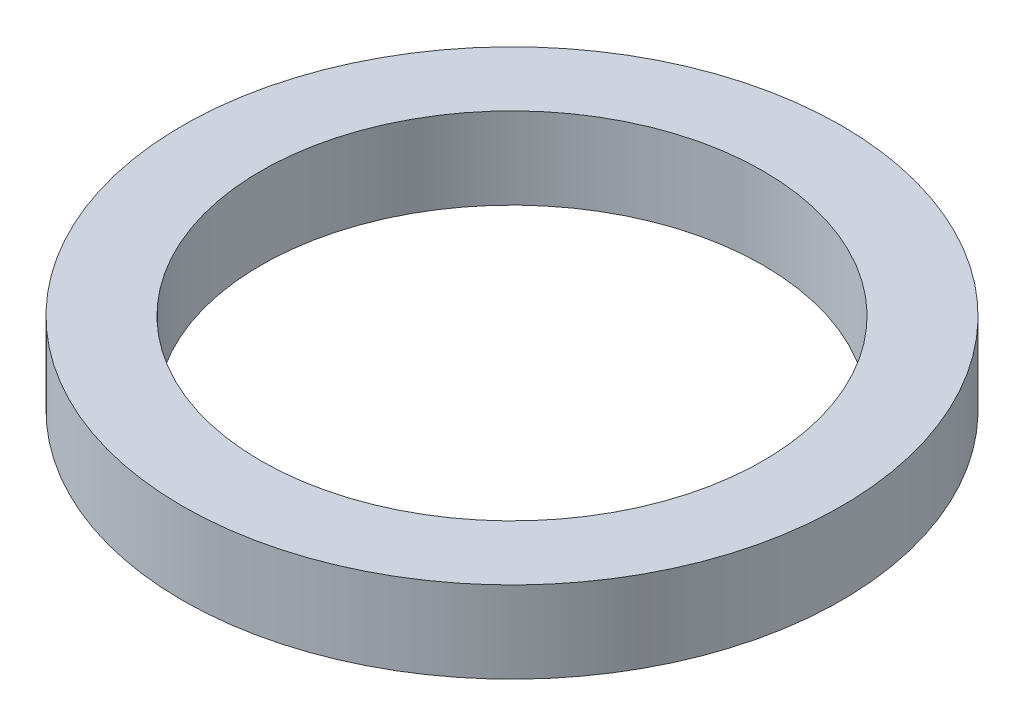
ISO-10303-21;
HEADER;
FILE_DESCRIPTION(('STEP AP214'),'2;1');
FILE_NAME('part.step','',(''),(''),'','','');
FILE_SCHEMA(('AUTOMOTIVE_DESIGN { 1 0 10303 214 1 1 1 1 }'));
ENDSEC;
DATA;
#1=APPLICATION_CONTEXT('core data for automotive mechanical design processes');
#2=APPLICATION_PROTOCOL_DEFINITION('international standard','automotive_design',2000,#1);
#3=PRODUCT_CONTEXT('',#1,'mechanical');
#4=PRODUCT('Part','Part','',(#3));
#5=PRODUCT_RELATED_PRODUCT_CATEGORY('part','',(#4));
#6=PRODUCT_DEFINITION_FORMATION('','',#4);
#7=PRODUCT_DEFINITION_CONTEXT('part definition',#1,'design');
#8=PRODUCT_DEFINITION('design','',#6,#7);
#9=PRODUCT_DEFINITION_SHAPE('','',#8);
#10=(LENGTH_UNIT() NAMED_UNIT(*) SI_UNIT(.MILLI.,.METRE.));
#11=(NAMED_UNIT(*) PLANE_ANGLE_UNIT() SI_UNIT($,.RADIAN.));
#12=(NAMED_UNIT(*) SI_UNIT($,.STERADIAN.) SOLID_ANGLE_UNIT());
#13=UNCERTAINTY_MEASURE_WITH_UNIT(LENGTH_MEASURE(1.E-05),#10,'distance_accuracy_value','');
#14=(GEOMETRIC_REPRESENTATION_CONTEXT(3) GLOBAL_UNCERTAINTY_ASSIGNED_CONTEXT((#13)) GLOBAL_UNIT_ASSIGNED_CONTEXT((#10,
#11,#12)) REPRESENTATION_CONTEXT('',''));
#15=CARTESIAN_POINT('',(0.,0.,0.));
#16=DIRECTION('',(0.,0.,1.));
#17=DIRECTION('',(1.,0.,0.));
#18=AXIS2_PLACEMENT_3D('',#15,#16,#17);
#19=CARTESIAN_POINT('',(0.,13.,0.));
#20=DIRECTION('',(0.,-1.,0.));
#21=DIRECTION('',(0.,0.,-1.));
#22=AXIS2_PLACEMENT_3D('',#19,#20,#21);
#23=CYLINDRICAL_SURFACE('',#22,52.5);
#24=CARTESIAN_POINT('',(0.,13.,0.));
#25=DIRECTION('',(0.,1.,0.));
#26=DIRECTION('',(0.,0.,1.));
#27=AXIS2_PLACEMENT_3D('',#24,#25,#26);
#28=CIRCLE('',#27,52.5);
#29=CARTESIAN_POINT('',(0.,13.,-52.5));
#30=VERTEX_POINT('',#29);
#31=EDGE_CURVE('E10',#30,#30,#28,.T.);
#32=CARTESIAN_POINT('',(0.,0.,0.));
#33=DIRECTION('',(0.,1.,0.));
#34=DIRECTION('',(0.,0.,1.));
#35=AXIS2_PLACEMENT_3D('',#32,#33,#34);
#36=CIRCLE('',#35,52.5);
#37=CARTESIAN_POINT('',(0.,0.,-52.5));
#38=VERTEX_POINT('',#37);
#39=EDGE_CURVE('E37',#38,#38,#36,.T.);
#40=CARTESIAN_POINT('',(0.,13.,-52.5));
#41=CARTESIAN_POINT('',(0.,12.8645833333333,-52.5));
#42=CARTESIAN_POINT('',(0.,12.7291666666667,-52.5));
#43=CARTESIAN_POINT('',(0.,12.4583333333333,-52.5));
#44=CARTESIAN_POINT('',(0.,12.3229166666667,-52.5));
#45=CARTESIAN_POINT('',(0.,12.0520833333333,-52.5));
#46=CARTESIAN_POINT('',(0.,11.9166666666667,-52.5));
#47=CARTESIAN_POINT('',(0.,11.6458333333333,-52.5));
#48=CARTESIAN_POINT('',(0.,11.5104166666667,-52.5));
#49=CARTESIAN_POINT('',(0.,11.2395833333333,-52.5));
#50=CARTESIAN_POINT('',(0.,11.1041666666667,-52.5));
#51=CARTESIAN_POINT('',(0.,10.8333333333333,-52.5));
#52=CARTESIAN_POINT('',(0.,10.6979166666667,-52.5));
#53=CARTESIAN_POINT('',(0.,10.4270833333333,-52.5));
#54=CARTESIAN_POINT('',(0.,10.2916666666667,-52.5));
#55=CARTESIAN_POINT('',(0.,10.0208333333333,-52.5));
#56=CARTESIAN_POINT('',(0.,9.88541666666667,-52.5));
#57=CARTESIAN_POINT('',(0.,9.61458333333333,-52.5));
#58=CARTESIAN_POINT('',(0.,9.47916666666667,-52.5));
#59=CARTESIAN_POINT('',(0.,9.20833333333333,-52.5));
#60=CARTESIAN_POINT('',(0.,9.07291666666667,-52.5));
#61=CARTESIAN_POINT('',(0.,8.80208333333333,-52.5));
#62=CARTESIAN_POINT('',(0.,8.66666666666667,-52.5));
#63=CARTESIAN_POINT('',(0.,8.39583333333333,-52.5));
#64=CARTESIAN_POINT('',(0.,8.26041666666667,-52.5));
#65=CARTESIAN_POINT('',(0.,7.98958333333333,-52.5));
#66=CARTESIAN_POINT('',(0.,7.85416666666667,-52.5));
#67=CARTESIAN_POINT('',(0.,7.58333333333333,-52.5));
#68=CARTESIAN_POINT('',(0.,7.44791666666667,-52.5));
#69=CARTESIAN_POINT('',(0.,7.17708333333333,-52.5));
#70=CARTESIAN_POINT('',(0.,7.04166666666667,-52.5));
#71=CARTESIAN_POINT('',(0.,6.77083333333333,-52.5));
#72=CARTESIAN_POINT('',(0.,6.63541666666667,-52.5));
#73=CARTESIAN_POINT('',(0.,6.36458333333333,-52.5));
#74=CARTESIAN_POINT('',(0.,6.22916666666667,-52.5));
#75=CARTESIAN_POINT('',(0.,5.95833333333333,-52.5));
#76=CARTESIAN_POINT('',(0.,5.82291666666667,-52.5));
#77=CARTESIAN_POINT('',(0.,5.55208333333333,-52.5));
#78=CARTESIAN_POINT('',(0.,5.41666666666667,-52.5));
#79=CARTESIAN_POINT('',(0.,5.14583333333333,-52.5));
#80=CARTESIAN_POINT('',(0.,5.01041666666667,-52.5));
#81=CARTESIAN_POINT('',(0.,4.73958333333333,-52.5));
#82=CARTESIAN_POINT('',(0.,4.60416666666667,-52.5));
#83=CARTESIAN_POINT('',(0.,4.33333333333333,-52.5));
#84=CARTESIAN_POINT('',(0.,4.19791666666667,-52.5));
#85=CARTESIAN_POINT('',(0.,3.92708333333333,-52.5));
#86=CARTESIAN_POINT('',(0.,3.79166666666667,-52.5));
#87=CARTESIAN_POINT('',(0.,3.52083333333333,-52.5));
#88=CARTESIAN_POINT('',(0.,3.38541666666667,-52.5));
#89=CARTESIAN_POINT('',(0.,3.11458333333333,-52.5));
#90=CARTESIAN_POINT('',(0.,2.97916666666667,-52.5));
#91=CARTESIAN_POINT('',(0.,2.70833333333333,-52.5));
#92=CARTESIAN_POINT('',(0.,2.57291666666667,-52.5));
#93=CARTESIAN_POINT('',(0.,2.30208333333333,-52.5));
#94=CARTESIAN_POINT('',(0.,2.16666666666667,-52.5));
#95=CARTESIAN_POINT('',(0.,1.89583333333333,-52.5));
#96=CARTESIAN_POINT('',(0.,1.76041666666667,-52.5));
#97=CARTESIAN_POINT('',(0.,1.48958333333333,-52.5));
#98=CARTESIAN_POINT('',(0.,1.35416666666667,-52.5));
#99=CARTESIAN_POINT('',(0.,1.08333333333333,-52.5));
#100=CARTESIAN_POINT('',(0.,0.947916666666667,-52.5));
#101=CARTESIAN_POINT('',(0.,0.677083333333334,-52.5));
#102=CARTESIAN_POINT('',(0.,0.541666666666667,-52.5));
#103=CARTESIAN_POINT('',(0.,0.270833333333334,-52.5));
#104=CARTESIAN_POINT('',(0.,0.135416666666667,-52.5));
#105=CARTESIAN_POINT('',(0.,0.,-52.5));
#106=B_SPLINE_CURVE_WITH_KNOTS('',3,(#40,#41,#42,#43,#44,#45,#46,#47,#48,#49,#50,#51,#52,#53,
#54,#55,#56,#57,#58,#59,#60,#61,#62,#63,#64,#65,#66,#67,#68,#69,#70,#71,#72,#73,#74,#75,#76,#77,
#78,#79,#80,#81,#82,#83,#84,#85,#86,#87,#88,#89,#90,#91,#92,#93,#94,#95,#96,#97,#98,#99,#100,
#101,#102,#103,#104,#105),.UNSPECIFIED.,.F.,.F.,(4,2,2,2,2,2,2,2,2,2,2,2,2,2,2,2,2,2,2,2,2,2,2,
2,2,2,2,2,2,2,2,2,4),(0.,0.406249999999999,0.812499999999999,1.21875,1.625,2.03125,2.4375,
2.84375,3.25,3.65625,4.0625,4.46875,4.875,5.28125,5.6875,6.09375,6.5,6.90625,7.3125,7.71875,
8.125,8.53125,8.9375,9.34375,9.75,10.15625,10.5625,10.96875,11.375,11.78125,12.1875,12.59375,
13.),.UNSPECIFIED.);
#107=EDGE_CURVE('BSEAM40',#30,#38,#106,.T.);
#108=ORIENTED_EDGE('',*,*,#31,.F.);
#109=ORIENTED_EDGE('',*,*,#39,.T.);
#110=ORIENTED_EDGE('',*,*,#107,.T.);
#111=ORIENTED_EDGE('',*,*,#107,.F.);
#112=EDGE_LOOP('',(#108,#110,#109,#111));
#113=FACE_BOUND('',#112,.T.);
#114=ADVANCED_FACE('F40',(#113),#23,.T.);
#115=CARTESIAN_POINT('',(0.,13.,0.));
#116=DIRECTION('',(0.,1.,0.));
#117=DIRECTION('',(0.,0.,1.));
#118=AXIS2_PLACEMENT_3D('',#115,#116,#117);
#119=PLANE('',#118);
#120=CARTESIAN_POINT('',(0.,13.,0.));
#121=DIRECTION('',(0.,1.,0.));
#122=DIRECTION('',(0.,0.,1.));
#123=AXIS2_PLACEMENT_3D('',#120,#121,#122);
#124=CIRCLE('',#123,40.);
#125=CARTESIAN_POINT('',(0.,13.,-40.));
#126=VERTEX_POINT('',#125);
#127=EDGE_CURVE('E50',#126,#126,#124,.T.);
#128=ORIENTED_EDGE('',*,*,#127,.F.);
#129=EDGE_LOOP('',(#128));
#130=FACE_BOUND('',#129,.T.);
#131=ORIENTED_EDGE('',*,*,#31,.T.);
#132=EDGE_LOOP('',(#131));
#133=FACE_BOUND('',#132,.T.);
#134=ADVANCED_FACE('F59',(#130,#133),#119,.T.);
#135=CARTESIAN_POINT('',(0.,0.,0.));
#136=DIRECTION('',(0.,1.,0.));
#137=DIRECTION('',(0.,0.,1.));
#138=AXIS2_PLACEMENT_3D('',#135,#136,#137);
#139=PLANE('',#138);
#140=CARTESIAN_POINT('',(0.,0.,0.));
#141=DIRECTION('',(0.,1.,0.));
#142=DIRECTION('',(0.,0.,1.));
#143=AXIS2_PLACEMENT_3D('',#140,#141,#142);
#144=CIRCLE('',#143,40.);
#145=CARTESIAN_POINT('',(0.,0.,-40.));
#146=VERTEX_POINT('',#145);
#147=EDGE_CURVE('E47',#146,#146,#144,.T.);
#148=ORIENTED_EDGE('',*,*,#147,.T.);
#149=EDGE_LOOP('',(#148));
#150=FACE_BOUND('',#149,.T.);
#151=ORIENTED_EDGE('',*,*,#39,.F.);
#152=EDGE_LOOP('',(#151));
#153=FACE_BOUND('',#152,.T.);
#154=ADVANCED_FACE('F58',(#150,#153),#139,.F.);
#155=CARTESIAN_POINT('',(0.,13.,0.));
#156=DIRECTION('',(0.,-1.,0.));
#157=DIRECTION('',(0.,0.,-1.));
#158=AXIS2_PLACEMENT_3D('',#155,#156,#157);
#159=CYLINDRICAL_SURFACE('',#158,40.);
#160=CARTESIAN_POINT('',(0.,13.,-40.));
#161=CARTESIAN_POINT('',(0.,12.8645833333333,-40.));
#162=CARTESIAN_POINT('',(0.,12.7291666666667,-40.));
#163=CARTESIAN_POINT('',(0.,12.4583333333333,-40.));
#164=CARTESIAN_POINT('',(0.,12.3229166666667,-40.));
#165=CARTESIAN_POINT('',(0.,12.0520833333333,-40.));
#166=CARTESIAN_POINT('',(0.,11.9166666666667,-40.));
#167=CARTESIAN_POINT('',(0.,11.6458333333333,-40.));
#168=CARTESIAN_POINT('',(0.,11.5104166666667,-40.));
#169=CARTESIAN_POINT('',(0.,11.2395833333333,-40.));
#170=CARTESIAN_POINT('',(0.,11.1041666666667,-40.));
#171=CARTESIAN_POINT('',(0.,10.8333333333333,-40.));
#172=CARTESIAN_POINT('',(0.,10.6979166666667,-40.));
#173=CARTESIAN_POINT('',(0.,10.4270833333333,-40.));
#174=CARTESIAN_POINT('',(0.,10.2916666666667,-40.));
#175=CARTESIAN_POINT('',(0.,10.0208333333333,-40.));
#176=CARTESIAN_POINT('',(0.,9.88541666666667,-40.));
#177=CARTESIAN_POINT('',(0.,9.61458333333333,-40.));
#178=CARTESIAN_POINT('',(0.,9.47916666666667,-40.));
#179=CARTESIAN_POINT('',(0.,9.20833333333333,-40.));
#180=CARTESIAN_POINT('',(0.,9.07291666666667,-40.));
#181=CARTESIAN_POINT('',(0.,8.80208333333333,-40.));
#182=CARTESIAN_POINT('',(0.,8.66666666666667,-40.));
#183=CARTESIAN_POINT('',(0.,8.39583333333333,-40.));
#184=CARTESIAN_POINT('',(0.,8.26041666666667,-40.));
#185=CARTESIAN_POINT('',(0.,7.98958333333333,-40.));
#186=CARTESIAN_POINT('',(0.,7.85416666666667,-40.));
#187=CARTESIAN_POINT('',(0.,7.58333333333333,-40.));
#188=CARTESIAN_POINT('',(0.,7.44791666666667,-40.));
#189=CARTESIAN_POINT('',(0.,7.17708333333333,-40.));
#190=CARTESIAN_POINT('',(0.,7.04166666666667,-40.));
#191=CARTESIAN_POINT('',(0.,6.77083333333333,-40.));
#192=CARTESIAN_POINT('',(0.,6.63541666666667,-40.));
#193=CARTESIAN_POINT('',(0.,6.36458333333333,-40.));
#194=CARTESIAN_POINT('',(0.,6.22916666666667,-40.));
#195=CARTESIAN_POINT('',(0.,5.95833333333333,-40.));
#196=CARTESIAN_POINT('',(0.,5.82291666666667,-40.));
#197=CARTESIAN_POINT('',(0.,5.55208333333333,-40.));
#198=CARTESIAN_POINT('',(0.,5.41666666666667,-40.));
#199=CARTESIAN_POINT('',(0.,5.14583333333333,-40.));
#200=CARTESIAN_POINT('',(0.,5.01041666666667,-40.));
#201=CARTESIAN_POINT('',(0.,4.73958333333333,-40.));
#202=CARTESIAN_POINT('',(0.,4.60416666666667,-40.));
#203=CARTESIAN_POINT('',(0.,4.33333333333333,-40.));
#204=CARTESIAN_POINT('',(0.,4.19791666666667,-40.));
#205=CARTESIAN_POINT('',(0.,3.92708333333333,-40.));
#206=CARTESIAN_POINT('',(0.,3.79166666666667,-40.));
#207=CARTESIAN_POINT('',(0.,3.52083333333333,-40.));
#208=CARTESIAN_POINT('',(0.,3.38541666666667,-40.));
#209=CARTESIAN_POINT('',(0.,3.11458333333333,-40.));
#210=CARTESIAN_POINT('',(0.,2.97916666666667,-40.));
#211=CARTESIAN_POINT('',(0.,2.70833333333333,-40.));
#212=CARTESIAN_POINT('',(0.,2.57291666666667,-40.));
#213=CARTESIAN_POINT('',(0.,2.30208333333333,-40.));
#214=CARTESIAN_POINT('',(0.,2.16666666666667,-40.));
#215=CARTESIAN_POINT('',(0.,1.89583333333333,-40.));
#216=CARTESIAN_POINT('',(0.,1.76041666666667,-40.));
#217=CARTESIAN_POINT('',(0.,1.48958333333333,-40.));
#218=CARTESIAN_POINT('',(0.,1.35416666666667,-40.));
#219=CARTESIAN_POINT('',(0.,1.08333333333333,-40.));
#220=CARTESIAN_POINT('',(0.,0.947916666666667,-40.));
#221=CARTESIAN_POINT('',(0.,0.677083333333334,-40.));
#222=CARTESIAN_POINT('',(0.,0.541666666666667,-40.));
#223=CARTESIAN_POINT('',(0.,0.270833333333334,-40.));
#224=CARTESIAN_POINT('',(0.,0.135416666666667,-40.));
#225=CARTESIAN_POINT('',(0.,0.,-40.));
#226=B_SPLINE_CURVE_WITH_KNOTS('',3,(#160,#161,#162,#163,#164,#165,#166,#167,#168,#169,#170,
#171,#172,#173,#174,#175,#176,#177,#178,#179,#180,#181,#182,#183,#184,#185,#186,#187,#188,#189,
#190,#191,#192,#193,#194,#195,#196,#197,#198,#199,#200,#201,#202,#203,#204,#205,#206,#207,#208,
#209,#210,#211,#212,#213,#214,#215,#216,#217,#218,#219,#220,#221,#222,#223,#224,#225),
.UNSPECIFIED.,.F.,.F.,(4,2,2,2,2,2,2,2,2,2,2,2,2,2,2,2,2,2,2,2,2,2,2,2,2,2,2,2,2,2,2,2,4),(0.,
0.406249999999999,0.812499999999999,1.21875,1.625,2.03125,2.4375,2.84375,3.25,3.65625,4.0625,
4.46875,4.875,5.28125,5.6875,6.09375,6.5,6.90625,7.3125,7.71875,8.125,8.53125,8.9375,9.34375,
9.75,10.15625,10.5625,10.96875,11.375,11.78125,12.1875,12.59375,13.),.UNSPECIFIED.);
#227=EDGE_CURVE('BSEAM54',#126,#146,#226,.T.);
#228=ORIENTED_EDGE('',*,*,#127,.T.);
#229=ORIENTED_EDGE('',*,*,#147,.F.);
#230=ORIENTED_EDGE('',*,*,#227,.T.);
#231=ORIENTED_EDGE('',*,*,#227,.F.);
#232=EDGE_LOOP('',(#228,#230,#229,#231));
#233=FACE_BOUND('',#232,.T.);
#234=ADVANCED_FACE('F54',(#233),#159,.F.);
#235=CLOSED_SHELL('',(#114,#134,#154,#234));
#236=MANIFOLD_SOLID_BREP('B2',#235);
#237=ADVANCED_BREP_SHAPE_REPRESENTATION('',(#18,#236),#14);
#238=SHAPE_DEFINITION_REPRESENTATION(#9,#237);
ENDSEC;
END-ISO-10303-21;
